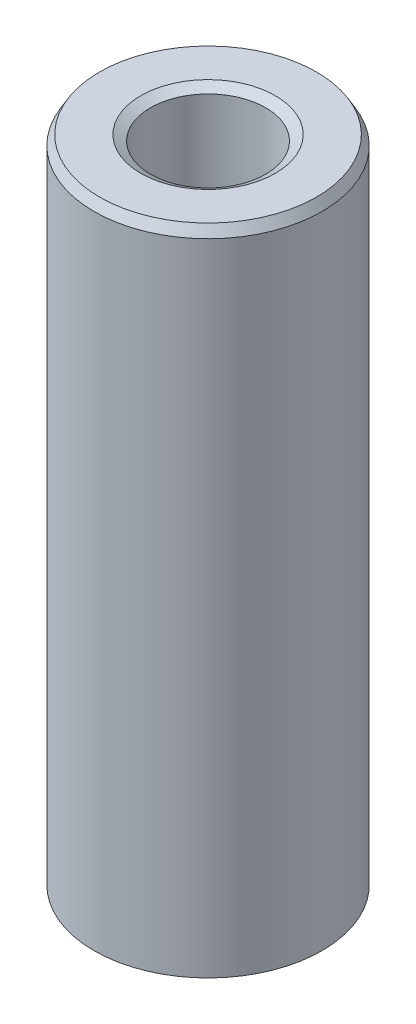
ISO-10303-21;
HEADER;
FILE_DESCRIPTION(('STEP AP214'),'2;1');
FILE_NAME('part.step','',(''),(''),'','','');
FILE_SCHEMA(('AUTOMOTIVE_DESIGN { 1 0 10303 214 1 1 1 1 }'));
ENDSEC;
DATA;
#1=APPLICATION_CONTEXT('core data for automotive mechanical design processes');
#2=APPLICATION_PROTOCOL_DEFINITION('international standard','automotive_design',2000,#1);
#3=PRODUCT_CONTEXT('',#1,'mechanical');
#4=PRODUCT('Part','Part','',(#3));
#5=PRODUCT_RELATED_PRODUCT_CATEGORY('part','',(#4));
#6=PRODUCT_DEFINITION_FORMATION('','',#4);
#7=PRODUCT_DEFINITION_CONTEXT('part definition',#1,'design');
#8=PRODUCT_DEFINITION('design','',#6,#7);
#9=PRODUCT_DEFINITION_SHAPE('','',#8);
#10=(LENGTH_UNIT() NAMED_UNIT(*) SI_UNIT(.MILLI.,.METRE.));
#11=(NAMED_UNIT(*) PLANE_ANGLE_UNIT() SI_UNIT($,.RADIAN.));
#12=(NAMED_UNIT(*) SI_UNIT($,.STERADIAN.) SOLID_ANGLE_UNIT());
#13=UNCERTAINTY_MEASURE_WITH_UNIT(LENGTH_MEASURE(1.E-05),#10,'distance_accuracy_value','');
#14=(GEOMETRIC_REPRESENTATION_CONTEXT(3) GLOBAL_UNCERTAINTY_ASSIGNED_CONTEXT((#13)) GLOBAL_UNIT_ASSIGNED_CONTEXT((#10,
#11,#12)) REPRESENTATION_CONTEXT('',''));
#15=CARTESIAN_POINT('',(0.,0.,0.));
#16=DIRECTION('',(0.,0.,1.));
#17=DIRECTION('',(1.,0.,0.));
#18=AXIS2_PLACEMENT_3D('',#15,#16,#17);
#19=CARTESIAN_POINT('',(0.,57.4882610414487,0.));
#20=DIRECTION('',(0.,-1.,0.));
#21=DIRECTION('',(0.,0.,-1.));
#22=AXIS2_PLACEMENT_3D('',#19,#20,#21);
#23=CYLINDRICAL_SURFACE('',#22,10.);
#24=CARTESIAN_POINT('',(0.,0.489490710089684,0.));
#25=DIRECTION('',(0.,1.,0.));
#26=DIRECTION('',(0.,0.,1.));
#27=AXIS2_PLACEMENT_3D('',#24,#25,#26);
#28=CIRCLE('',#27,10.);
#29=CARTESIAN_POINT('',(0.,0.489490710089684,10.));
#30=VERTEX_POINT('',#29);
#31=EDGE_CURVE('E10',#30,#30,#28,.T.);
#32=ORIENTED_EDGE('',*,*,#31,.T.);
#33=EDGE_LOOP('',(#32));
#34=FACE_BOUND('',#33,.T.);
#35=CARTESIAN_POINT('',(0.,56.6404382617404,0.));
#36=DIRECTION('',(0.,1.,0.));
#37=DIRECTION('',(0.,0.,1.));
#38=AXIS2_PLACEMENT_3D('',#35,#36,#37);
#39=CIRCLE('',#38,10.);
#40=CARTESIAN_POINT('',(0.,56.6404382617404,10.));
#41=VERTEX_POINT('',#40);
#42=EDGE_CURVE('E50',#41,#41,#39,.F.);
#43=ORIENTED_EDGE('',*,*,#42,.T.);
#44=EDGE_LOOP('',(#43));
#45=FACE_BOUND('',#44,.T.);
#46=ADVANCED_FACE('F39',(#34,#45),#23,.T.);
#47=CARTESIAN_POINT('',(0.,57.4882610414487,0.));
#48=DIRECTION('',(0.,1.,0.));
#49=DIRECTION('',(0.,0.,1.));
#50=AXIS2_PLACEMENT_3D('',#47,#48,#49);
#51=PLANE('',#50);
#52=CARTESIAN_POINT('',(0.,57.4882610414487,0.));
#53=DIRECTION('',(0.,1.,0.));
#54=DIRECTION('',(0.,0.,1.));
#55=AXIS2_PLACEMENT_3D('',#52,#53,#54);
#56=CIRCLE('',#55,5.90224757734256);
#57=CARTESIAN_POINT('',(0.,57.4882610414487,5.90224757734256));
#58=VERTEX_POINT('',#57);
#59=EDGE_CURVE('E58',#58,#58,#56,.F.);
#60=ORIENTED_EDGE('',*,*,#59,.T.);
#61=EDGE_LOOP('',(#60));
#62=FACE_BOUND('',#61,.T.);
#63=CARTESIAN_POINT('',(0.,57.4882610414487,0.));
#64=DIRECTION('',(0.,1.,0.));
#65=DIRECTION('',(0.,0.,1.));
#66=AXIS2_PLACEMENT_3D('',#63,#64,#65);
#67=CIRCLE('',#66,9.5105092899103);
#68=CARTESIAN_POINT('',(0.,57.4882610414487,9.5105092899103));
#69=VERTEX_POINT('',#68);
#70=EDGE_CURVE('E61',#69,#69,#67,.T.);
#71=ORIENTED_EDGE('',*,*,#70,.T.);
#72=EDGE_LOOP('',(#71));
#73=FACE_BOUND('',#72,.T.);
#74=ADVANCED_FACE('F88',(#62,#73),#51,.T.);
#75=CARTESIAN_POINT('',(0.,0.,0.));
#76=DIRECTION('',(0.,1.,0.));
#77=DIRECTION('',(0.,0.,1.));
#78=AXIS2_PLACEMENT_3D('',#75,#76,#77);
#79=PLANE('',#78);
#80=CARTESIAN_POINT('',(0.,0.,0.));
#81=DIRECTION('',(0.,1.,0.));
#82=DIRECTION('',(0.,0.,1.));
#83=AXIS2_PLACEMENT_3D('',#80,#81,#82);
#84=CIRCLE('',#83,5.54391550772393);
#85=CARTESIAN_POINT('',(0.,0.,5.54391550772393));
#86=VERTEX_POINT('',#85);
#87=EDGE_CURVE('E51',#86,#86,#84,.T.);
#88=ORIENTED_EDGE('',*,*,#87,.T.);
#89=EDGE_LOOP('',(#88));
#90=FACE_BOUND('',#89,.T.);
#91=CARTESIAN_POINT('',(0.,0.,0.));
#92=DIRECTION('',(0.,1.,0.));
#93=DIRECTION('',(0.,0.,1.));
#94=AXIS2_PLACEMENT_3D('',#91,#92,#93);
#95=CIRCLE('',#94,9.15217722029169);
#96=CARTESIAN_POINT('',(0.,0.,9.15217722029169));
#97=VERTEX_POINT('',#96);
#98=EDGE_CURVE('E54',#97,#97,#95,.F.);
#99=ORIENTED_EDGE('',*,*,#98,.T.);
#100=EDGE_LOOP('',(#99));
#101=FACE_BOUND('',#100,.T.);
#102=ADVANCED_FACE('F83',(#90,#101),#79,.F.);
#103=CARTESIAN_POINT('',(0.,57.4882610414487,0.));
#104=DIRECTION('',(0.,-1.,0.));
#105=DIRECTION('',(0.,0.,-1.));
#106=AXIS2_PLACEMENT_3D('',#103,#104,#105);
#107=CYLINDRICAL_SURFACE('',#106,5.05442479763424);
#108=CARTESIAN_POINT('',(0.,56.998770331359,0.));
#109=DIRECTION('',(0.,1.,0.));
#110=DIRECTION('',(0.,0.,1.));
#111=AXIS2_PLACEMENT_3D('',#108,#109,#110);
#112=CIRCLE('',#111,5.05442479763424);
#113=CARTESIAN_POINT('',(0.,56.998770331359,5.05442479763424));
#114=VERTEX_POINT('',#113);
#115=EDGE_CURVE('E67',#114,#114,#112,.T.);
#116=ORIENTED_EDGE('',*,*,#115,.T.);
#117=EDGE_LOOP('',(#116));
#118=FACE_BOUND('',#117,.T.);
#119=CARTESIAN_POINT('',(0.,0.84782277970831,0.));
#120=DIRECTION('',(0.,1.,0.));
#121=DIRECTION('',(0.,0.,1.));
#122=AXIS2_PLACEMENT_3D('',#119,#120,#121);
#123=CIRCLE('',#122,5.05442479763424);
#124=CARTESIAN_POINT('',(0.,0.84782277970831,5.05442479763424));
#125=VERTEX_POINT('',#124);
#126=EDGE_CURVE('E69',#125,#125,#123,.F.);
#127=ORIENTED_EDGE('',*,*,#126,.T.);
#128=EDGE_LOOP('',(#127));
#129=FACE_BOUND('',#128,.T.);
#130=ADVANCED_FACE('F71',(#118,#129),#107,.F.);
#131=CARTESIAN_POINT('',(0.,56.998770331359,0.));
#132=DIRECTION('',(0.,1.,0.));
#133=DIRECTION('',(0.,0.,1.));
#134=AXIS2_PLACEMENT_3D('',#131,#132,#133);
#135=CONICAL_SURFACE('',#134,5.05442479763424,1.0471975511966);
#136=ORIENTED_EDGE('',*,*,#59,.F.);
#137=EDGE_LOOP('',(#136));
#138=FACE_BOUND('',#137,.T.);
#139=ORIENTED_EDGE('',*,*,#115,.F.);
#140=EDGE_LOOP('',(#139));
#141=FACE_BOUND('',#140,.T.);
#142=ADVANCED_FACE('F77',(#138,#141),#135,.F.);
#143=CARTESIAN_POINT('',(0.,0.,0.));
#144=DIRECTION('',(0.,-1.,0.));
#145=DIRECTION('',(0.,0.,-1.));
#146=AXIS2_PLACEMENT_3D('',#143,#144,#145);
#147=CONICAL_SURFACE('',#146,5.54391550772393,0.523598775598301);
#148=ORIENTED_EDGE('',*,*,#126,.F.);
#149=EDGE_LOOP('',(#148));
#150=FACE_BOUND('',#149,.T.);
#151=ORIENTED_EDGE('',*,*,#87,.F.);
#152=EDGE_LOOP('',(#151));
#153=FACE_BOUND('',#152,.T.);
#154=ADVANCED_FACE('F73',(#150,#153),#147,.F.);
#155=CARTESIAN_POINT('',(0.,0.489490710089684,0.));
#156=DIRECTION('',(0.,1.,0.));
#157=DIRECTION('',(0.,0.,1.));
#158=AXIS2_PLACEMENT_3D('',#155,#156,#157);
#159=CONICAL_SURFACE('',#158,10.,1.0471975511966);
#160=ORIENTED_EDGE('',*,*,#98,.F.);
#161=EDGE_LOOP('',(#160));
#162=FACE_BOUND('',#161,.T.);
#163=ORIENTED_EDGE('',*,*,#31,.F.);
#164=EDGE_LOOP('',(#163));
#165=FACE_BOUND('',#164,.T.);
#166=ADVANCED_FACE('F76',(#162,#165),#159,.T.);
#167=CARTESIAN_POINT('',(0.,57.4882610414487,0.));
#168=DIRECTION('',(0.,-1.,0.));
#169=DIRECTION('',(0.,0.,-1.));
#170=AXIS2_PLACEMENT_3D('',#167,#168,#169);
#171=CONICAL_SURFACE('',#170,9.5105092899103,0.523598775598292);
#172=ORIENTED_EDGE('',*,*,#42,.F.);
#173=EDGE_LOOP('',(#172));
#174=FACE_BOUND('',#173,.T.);
#175=ORIENTED_EDGE('',*,*,#70,.F.);
#176=EDGE_LOOP('',(#175));
#177=FACE_BOUND('',#176,.T.);
#178=ADVANCED_FACE('F45',(#174,#177),#171,.T.);
#179=CLOSED_SHELL('',(#46,#74,#102,#130,#142,#154,#166,#178));
#180=MANIFOLD_SOLID_BREP('B2',#179);
#181=ADVANCED_BREP_SHAPE_REPRESENTATION('',(#18,#180),#14);
#182=SHAPE_DEFINITION_REPRESENTATION(#9,#181);
ENDSEC;
END-ISO-10303-21;
